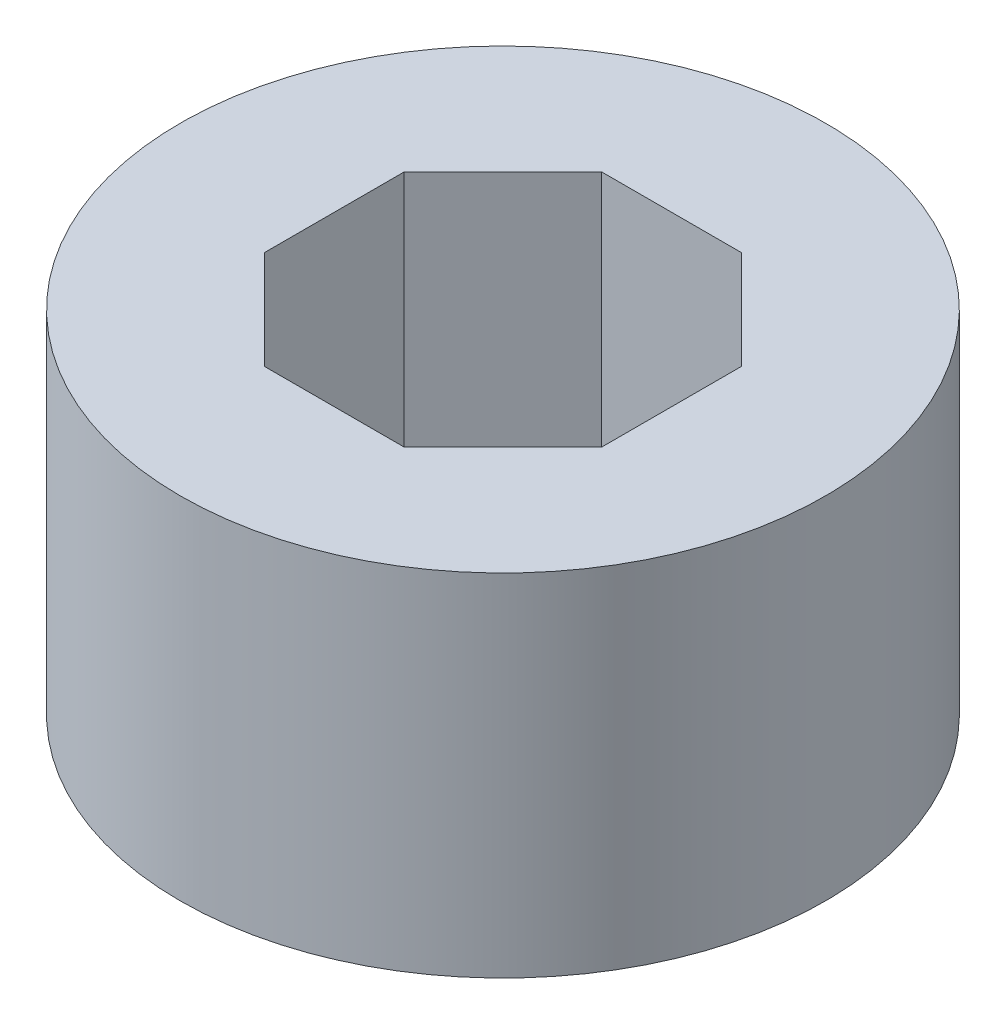
ISO-10303-21;
HEADER;
FILE_DESCRIPTION(('STEP AP214'),'2;1');
FILE_NAME('part.step','',(''),(''),'','','');
FILE_SCHEMA(('AUTOMOTIVE_DESIGN { 1 0 10303 214 1 1 1 1 }'));
ENDSEC;
DATA;
#1=APPLICATION_CONTEXT('core data for automotive mechanical design processes');
#2=APPLICATION_PROTOCOL_DEFINITION('international standard','automotive_design',2000,#1);
#3=PRODUCT_CONTEXT('',#1,'mechanical');
#4=PRODUCT('Part','Part','',(#3));
#5=PRODUCT_RELATED_PRODUCT_CATEGORY('part','',(#4));
#6=PRODUCT_DEFINITION_FORMATION('','',#4);
#7=PRODUCT_DEFINITION_CONTEXT('part definition',#1,'design');
#8=PRODUCT_DEFINITION('design','',#6,#7);
#9=PRODUCT_DEFINITION_SHAPE('','',#8);
#10=(LENGTH_UNIT() NAMED_UNIT(*) SI_UNIT(.MILLI.,.METRE.));
#11=(NAMED_UNIT(*) PLANE_ANGLE_UNIT() SI_UNIT($,.RADIAN.));
#12=(NAMED_UNIT(*) SI_UNIT($,.STERADIAN.) SOLID_ANGLE_UNIT());
#13=UNCERTAINTY_MEASURE_WITH_UNIT(LENGTH_MEASURE(1.E-05),#10,'distance_accuracy_value','');
#14=(GEOMETRIC_REPRESENTATION_CONTEXT(3) GLOBAL_UNCERTAINTY_ASSIGNED_CONTEXT((#13)) GLOBAL_UNIT_ASSIGNED_CONTEXT((#10,
#11,#12)) REPRESENTATION_CONTEXT('',''));
#15=CARTESIAN_POINT('',(0.,0.,0.));
#16=DIRECTION('',(0.,0.,1.));
#17=DIRECTION('',(1.,0.,0.));
#18=AXIS2_PLACEMENT_3D('',#15,#16,#17);
#19=CARTESIAN_POINT('',(0.,5.,0.));
#20=DIRECTION('',(0.,1.,0.));
#21=DIRECTION('',(0.,0.,1.));
#22=AXIS2_PLACEMENT_3D('',#19,#20,#21);
#23=PLANE('',#22);
#24=CARTESIAN_POINT('',(0.,5.,0.));
#25=DIRECTION('',(0.,1.,0.));
#26=DIRECTION('',(0.,0.,1.));
#27=AXIS2_PLACEMENT_3D('',#24,#25,#26);
#28=CIRCLE('',#27,4.6);
#29=CARTESIAN_POINT('',(0.,5.,4.6));
#30=VERTEX_POINT('',#29);
#31=EDGE_CURVE('E11',#30,#30,#28,.T.);
#32=ORIENTED_EDGE('',*,*,#31,.T.);
#33=EDGE_LOOP('',(#32));
#34=FACE_BOUND('',#33,.T.);
#35=DIRECTION('',(-0.707106781186547,0.,0.707106781186548));
#36=VECTOR('',#35,1.);
#37=CARTESIAN_POINT('',(-0.994976924149234,5.,-2.40208678452935));
#38=LINE('',#37,#36);
#39=CARTESIAN_POINT('',(-0.994976924149234,5.,-2.40208678452935));
#40=VERTEX_POINT('',#39);
#41=CARTESIAN_POINT('',(-2.40208678452935,5.,-0.994976924149233));
#42=VERTEX_POINT('',#41);
#43=EDGE_CURVE('E114',#40,#42,#38,.T.);
#44=ORIENTED_EDGE('',*,*,#43,.F.);
#45=DIRECTION('',(-1.,0.,0.));
#46=VECTOR('',#45,1.);
#47=CARTESIAN_POINT('',(0.994976924149234,5.,-2.40208678452935));
#48=LINE('',#47,#46);
#49=CARTESIAN_POINT('',(0.994976924149234,5.,-2.40208678452935));
#50=VERTEX_POINT('',#49);
#51=EDGE_CURVE('E105',#50,#40,#48,.T.);
#52=ORIENTED_EDGE('',*,*,#51,.F.);
#53=DIRECTION('',(-0.707106781186548,0.,-0.707106781186548));
#54=VECTOR('',#53,1.);
#55=CARTESIAN_POINT('',(2.40208678452935,5.,-0.994976924149234));
#56=LINE('',#55,#54);
#57=CARTESIAN_POINT('',(2.40208678452935,5.,-0.994976924149234));
#58=VERTEX_POINT('',#57);
#59=EDGE_CURVE('E145',#58,#50,#56,.T.);
#60=ORIENTED_EDGE('',*,*,#59,.F.);
#61=DIRECTION('',(0.,0.,-1.));
#62=VECTOR('',#61,1.);
#63=CARTESIAN_POINT('',(2.40208678452935,5.,0.994976924149233));
#64=LINE('',#63,#62);
#65=CARTESIAN_POINT('',(2.40208678452935,5.,0.994976924149233));
#66=VERTEX_POINT('',#65);
#67=EDGE_CURVE('E142',#66,#58,#64,.T.);
#68=ORIENTED_EDGE('',*,*,#67,.F.);
#69=DIRECTION('',(0.707106781186547,0.,-0.707106781186548));
#70=VECTOR('',#69,1.);
#71=CARTESIAN_POINT('',(0.994976924149233,5.,2.40208678452935));
#72=LINE('',#71,#70);
#73=CARTESIAN_POINT('',(0.994976924149233,5.,2.40208678452935));
#74=VERTEX_POINT('',#73);
#75=EDGE_CURVE('E139',#74,#66,#72,.T.);
#76=ORIENTED_EDGE('',*,*,#75,.F.);
#77=DIRECTION('',(1.,0.,0.));
#78=VECTOR('',#77,1.);
#79=CARTESIAN_POINT('',(-0.994976924149233,5.,2.40208678452935));
#80=LINE('',#79,#78);
#81=CARTESIAN_POINT('',(-0.994976924149233,5.,2.40208678452935));
#82=VERTEX_POINT('',#81);
#83=EDGE_CURVE('E136',#82,#74,#80,.T.);
#84=ORIENTED_EDGE('',*,*,#83,.F.);
#85=DIRECTION('',(0.707106781186548,0.,0.707106781186547));
#86=VECTOR('',#85,1.);
#87=CARTESIAN_POINT('',(-2.40208678452935,5.,0.994976924149234));
#88=LINE('',#87,#86);
#89=CARTESIAN_POINT('',(-2.40208678452935,5.,0.994976924149234));
#90=VERTEX_POINT('',#89);
#91=EDGE_CURVE('E131',#90,#82,#88,.T.);
#92=ORIENTED_EDGE('',*,*,#91,.F.);
#93=DIRECTION('',(0.,0.,1.));
#94=VECTOR('',#93,1.);
#95=CARTESIAN_POINT('',(-2.40208678452935,5.,-0.994976924149233));
#96=LINE('',#95,#94);
#97=EDGE_CURVE('E127',#42,#90,#96,.T.);
#98=ORIENTED_EDGE('',*,*,#97,.F.);
#99=EDGE_LOOP('',(#44,#52,#60,#68,#76,#84,#92,#98));
#100=FACE_BOUND('',#99,.T.);
#101=ADVANCED_FACE('F39',(#34,#100),#23,.T.);
#102=CARTESIAN_POINT('',(0.,0.,0.));
#103=DIRECTION('',(0.,1.,0.));
#104=DIRECTION('',(0.,0.,1.));
#105=AXIS2_PLACEMENT_3D('',#102,#103,#104);
#106=PLANE('',#105);
#107=CARTESIAN_POINT('',(0.,0.,0.));
#108=DIRECTION('',(0.,1.,0.));
#109=DIRECTION('',(0.,0.,1.));
#110=AXIS2_PLACEMENT_3D('',#107,#108,#109);
#111=CIRCLE('',#110,4.6);
#112=CARTESIAN_POINT('',(0.,0.,4.6));
#113=VERTEX_POINT('',#112);
#114=EDGE_CURVE('E43',#113,#113,#111,.T.);
#115=ORIENTED_EDGE('',*,*,#114,.F.);
#116=EDGE_LOOP('',(#115));
#117=FACE_BOUND('',#116,.T.);
#118=DIRECTION('',(-1.,0.,0.));
#119=VECTOR('',#118,1.);
#120=CARTESIAN_POINT('',(0.994976924149234,0.,-2.40208678452935));
#121=LINE('',#120,#119);
#122=CARTESIAN_POINT('',(0.994976924149234,0.,-2.40208678452935));
#123=VERTEX_POINT('',#122);
#124=CARTESIAN_POINT('',(-0.994976924149234,0.,-2.40208678452935));
#125=VERTEX_POINT('',#124);
#126=EDGE_CURVE('E63',#123,#125,#121,.T.);
#127=ORIENTED_EDGE('',*,*,#126,.T.);
#128=DIRECTION('',(-0.707106781186547,0.,0.707106781186548));
#129=VECTOR('',#128,1.);
#130=CARTESIAN_POINT('',(-0.994976924149234,0.,-2.40208678452935));
#131=LINE('',#130,#129);
#132=CARTESIAN_POINT('',(-2.40208678452935,0.,-0.994976924149233));
#133=VERTEX_POINT('',#132);
#134=EDGE_CURVE('E121',#125,#133,#131,.T.);
#135=ORIENTED_EDGE('',*,*,#134,.T.);
#136=DIRECTION('',(0.,0.,1.));
#137=VECTOR('',#136,1.);
#138=CARTESIAN_POINT('',(-2.40208678452935,0.,-0.994976924149233));
#139=LINE('',#138,#137);
#140=CARTESIAN_POINT('',(-2.40208678452935,0.,0.994976924149234));
#141=VERTEX_POINT('',#140);
#142=EDGE_CURVE('E152',#133,#141,#139,.T.);
#143=ORIENTED_EDGE('',*,*,#142,.T.);
#144=DIRECTION('',(0.707106781186548,0.,0.707106781186547));
#145=VECTOR('',#144,1.);
#146=CARTESIAN_POINT('',(-2.40208678452935,0.,0.994976924149234));
#147=LINE('',#146,#145);
#148=CARTESIAN_POINT('',(-0.994976924149233,0.,2.40208678452935));
#149=VERTEX_POINT('',#148);
#150=EDGE_CURVE('E156',#141,#149,#147,.T.);
#151=ORIENTED_EDGE('',*,*,#150,.T.);
#152=DIRECTION('',(1.,0.,0.));
#153=VECTOR('',#152,1.);
#154=CARTESIAN_POINT('',(-0.994976924149233,0.,2.40208678452935));
#155=LINE('',#154,#153);
#156=CARTESIAN_POINT('',(0.994976924149233,0.,2.40208678452935));
#157=VERTEX_POINT('',#156);
#158=EDGE_CURVE('E160',#149,#157,#155,.T.);
#159=ORIENTED_EDGE('',*,*,#158,.T.);
#160=DIRECTION('',(0.707106781186547,0.,-0.707106781186548));
#161=VECTOR('',#160,1.);
#162=CARTESIAN_POINT('',(0.994976924149233,0.,2.40208678452935));
#163=LINE('',#162,#161);
#164=CARTESIAN_POINT('',(2.40208678452935,0.,0.994976924149233));
#165=VERTEX_POINT('',#164);
#166=EDGE_CURVE('E164',#157,#165,#163,.T.);
#167=ORIENTED_EDGE('',*,*,#166,.T.);
#168=DIRECTION('',(0.,0.,-1.));
#169=VECTOR('',#168,1.);
#170=CARTESIAN_POINT('',(2.40208678452935,0.,0.994976924149233));
#171=LINE('',#170,#169);
#172=CARTESIAN_POINT('',(2.40208678452935,0.,-0.994976924149234));
#173=VERTEX_POINT('',#172);
#174=EDGE_CURVE('E168',#165,#173,#171,.T.);
#175=ORIENTED_EDGE('',*,*,#174,.T.);
#176=DIRECTION('',(-0.707106781186548,0.,-0.707106781186548));
#177=VECTOR('',#176,1.);
#178=CARTESIAN_POINT('',(2.40208678452935,0.,-0.994976924149234));
#179=LINE('',#178,#177);
#180=EDGE_CURVE('E115',#173,#123,#179,.T.);
#181=ORIENTED_EDGE('',*,*,#180,.T.);
#182=EDGE_LOOP('',(#127,#135,#143,#151,#159,#167,#175,#181));
#183=FACE_BOUND('',#182,.T.);
#184=ADVANCED_FACE('F198',(#117,#183),#106,.F.);
#185=CARTESIAN_POINT('',(0.,5.,0.));
#186=DIRECTION('',(0.,-1.,0.));
#187=DIRECTION('',(0.,0.,-1.));
#188=AXIS2_PLACEMENT_3D('',#185,#186,#187);
#189=CYLINDRICAL_SURFACE('',#188,4.6);
#190=ORIENTED_EDGE('',*,*,#31,.F.);
#191=EDGE_LOOP('',(#190));
#192=FACE_BOUND('',#191,.T.);
#193=ORIENTED_EDGE('',*,*,#114,.T.);
#194=EDGE_LOOP('',(#193));
#195=FACE_BOUND('',#194,.T.);
#196=ADVANCED_FACE('F41',(#192,#195),#189,.T.);
#197=CARTESIAN_POINT('',(0.994976924149234,5.,-2.40208678452935));
#198=DIRECTION('',(0.,0.,1.));
#199=DIRECTION('',(1.,0.,0.));
#200=AXIS2_PLACEMENT_3D('',#197,#198,#199);
#201=PLANE('',#200);
#202=ORIENTED_EDGE('',*,*,#126,.F.);
#203=DIRECTION('',(0.,-1.,0.));
#204=VECTOR('',#203,1.);
#205=CARTESIAN_POINT('',(0.994976924149234,5.,-2.40208678452935));
#206=LINE('',#205,#204);
#207=EDGE_CURVE('E109',#50,#123,#206,.T.);
#208=ORIENTED_EDGE('',*,*,#207,.F.);
#209=ORIENTED_EDGE('',*,*,#51,.T.);
#210=DIRECTION('',(0.,-1.,0.));
#211=VECTOR('',#210,1.);
#212=CARTESIAN_POINT('',(-0.994976924149234,5.,-2.40208678452935));
#213=LINE('',#212,#211);
#214=EDGE_CURVE('E108',#40,#125,#213,.T.);
#215=ORIENTED_EDGE('',*,*,#214,.T.);
#216=EDGE_LOOP('',(#202,#208,#209,#215));
#217=FACE_BOUND('',#216,.T.);
#218=ADVANCED_FACE('F107',(#217),#201,.T.);
#219=CARTESIAN_POINT('',(-0.994976924149234,5.,-2.40208678452935));
#220=DIRECTION('',(0.707106781186548,0.,0.707106781186547));
#221=DIRECTION('',(0.707106781186547,0.,-0.707106781186548));
#222=AXIS2_PLACEMENT_3D('',#219,#220,#221);
#223=PLANE('',#222);
#224=ORIENTED_EDGE('',*,*,#134,.F.);
#225=ORIENTED_EDGE('',*,*,#214,.F.);
#226=ORIENTED_EDGE('',*,*,#43,.T.);
#227=DIRECTION('',(0.,-1.,0.));
#228=VECTOR('',#227,1.);
#229=CARTESIAN_POINT('',(-2.40208678452935,5.,-0.994976924149233));
#230=LINE('',#229,#228);
#231=EDGE_CURVE('E123',#42,#133,#230,.T.);
#232=ORIENTED_EDGE('',*,*,#231,.T.);
#233=EDGE_LOOP('',(#224,#225,#226,#232));
#234=FACE_BOUND('',#233,.T.);
#235=ADVANCED_FACE('F118',(#234),#223,.T.);
#236=CARTESIAN_POINT('',(-2.40208678452935,5.,-0.994976924149233));
#237=DIRECTION('',(1.,0.,0.));
#238=DIRECTION('',(0.,0.,-1.));
#239=AXIS2_PLACEMENT_3D('',#236,#237,#238);
#240=PLANE('',#239);
#241=ORIENTED_EDGE('',*,*,#142,.F.);
#242=ORIENTED_EDGE('',*,*,#231,.F.);
#243=ORIENTED_EDGE('',*,*,#97,.T.);
#244=DIRECTION('',(0.,-1.,0.));
#245=VECTOR('',#244,1.);
#246=CARTESIAN_POINT('',(-2.40208678452935,5.,0.994976924149234));
#247=LINE('',#246,#245);
#248=EDGE_CURVE('E188',#90,#141,#247,.T.);
#249=ORIENTED_EDGE('',*,*,#248,.T.);
#250=EDGE_LOOP('',(#241,#242,#243,#249));
#251=FACE_BOUND('',#250,.T.);
#252=ADVANCED_FACE('F194',(#251),#240,.T.);
#253=CARTESIAN_POINT('',(-2.40208678452935,5.,0.994976924149234));
#254=DIRECTION('',(0.707106781186547,0.,-0.707106781186548));
#255=DIRECTION('',(-0.707106781186548,0.,-0.707106781186547));
#256=AXIS2_PLACEMENT_3D('',#253,#254,#255);
#257=PLANE('',#256);
#258=ORIENTED_EDGE('',*,*,#150,.F.);
#259=ORIENTED_EDGE('',*,*,#248,.F.);
#260=ORIENTED_EDGE('',*,*,#91,.T.);
#261=DIRECTION('',(0.,-1.,0.));
#262=VECTOR('',#261,1.);
#263=CARTESIAN_POINT('',(-0.994976924149233,5.,2.40208678452935));
#264=LINE('',#263,#262);
#265=EDGE_CURVE('E185',#82,#149,#264,.T.);
#266=ORIENTED_EDGE('',*,*,#265,.T.);
#267=EDGE_LOOP('',(#258,#259,#260,#266));
#268=FACE_BOUND('',#267,.T.);
#269=ADVANCED_FACE('F216',(#268),#257,.T.);
#270=CARTESIAN_POINT('',(-0.994976924149233,5.,2.40208678452935));
#271=DIRECTION('',(0.,0.,-1.));
#272=DIRECTION('',(-1.,0.,0.));
#273=AXIS2_PLACEMENT_3D('',#270,#271,#272);
#274=PLANE('',#273);
#275=ORIENTED_EDGE('',*,*,#158,.F.);
#276=ORIENTED_EDGE('',*,*,#265,.F.);
#277=ORIENTED_EDGE('',*,*,#83,.T.);
#278=DIRECTION('',(0.,-1.,0.));
#279=VECTOR('',#278,1.);
#280=CARTESIAN_POINT('',(0.994976924149233,5.,2.40208678452935));
#281=LINE('',#280,#279);
#282=EDGE_CURVE('E182',#74,#157,#281,.T.);
#283=ORIENTED_EDGE('',*,*,#282,.T.);
#284=EDGE_LOOP('',(#275,#276,#277,#283));
#285=FACE_BOUND('',#284,.T.);
#286=ADVANCED_FACE('F213',(#285),#274,.T.);
#287=CARTESIAN_POINT('',(0.994976924149233,5.,2.40208678452935));
#288=DIRECTION('',(-0.707106781186548,0.,-0.707106781186547));
#289=DIRECTION('',(-0.707106781186547,0.,0.707106781186548));
#290=AXIS2_PLACEMENT_3D('',#287,#288,#289);
#291=PLANE('',#290);
#292=ORIENTED_EDGE('',*,*,#166,.F.);
#293=ORIENTED_EDGE('',*,*,#282,.F.);
#294=ORIENTED_EDGE('',*,*,#75,.T.);
#295=DIRECTION('',(0.,-1.,0.));
#296=VECTOR('',#295,1.);
#297=CARTESIAN_POINT('',(2.40208678452935,5.,0.994976924149233));
#298=LINE('',#297,#296);
#299=EDGE_CURVE('E179',#66,#165,#298,.T.);
#300=ORIENTED_EDGE('',*,*,#299,.T.);
#301=EDGE_LOOP('',(#292,#293,#294,#300));
#302=FACE_BOUND('',#301,.T.);
#303=ADVANCED_FACE('F209',(#302),#291,.T.);
#304=CARTESIAN_POINT('',(2.40208678452935,5.,0.994976924149233));
#305=DIRECTION('',(-1.,0.,0.));
#306=DIRECTION('',(0.,0.,1.));
#307=AXIS2_PLACEMENT_3D('',#304,#305,#306);
#308=PLANE('',#307);
#309=ORIENTED_EDGE('',*,*,#174,.F.);
#310=ORIENTED_EDGE('',*,*,#299,.F.);
#311=ORIENTED_EDGE('',*,*,#67,.T.);
#312=DIRECTION('',(0.,-1.,0.));
#313=VECTOR('',#312,1.);
#314=CARTESIAN_POINT('',(2.40208678452935,5.,-0.994976924149234));
#315=LINE('',#314,#313);
#316=EDGE_CURVE('E55',#58,#173,#315,.T.);
#317=ORIENTED_EDGE('',*,*,#316,.T.);
#318=EDGE_LOOP('',(#309,#310,#311,#317));
#319=FACE_BOUND('',#318,.T.);
#320=ADVANCED_FACE('F206',(#319),#308,.T.);
#321=CARTESIAN_POINT('',(2.40208678452935,5.,-0.994976924149234));
#322=DIRECTION('',(-0.707106781186548,0.,0.707106781186548));
#323=DIRECTION('',(0.707106781186548,0.,0.707106781186548));
#324=AXIS2_PLACEMENT_3D('',#321,#322,#323);
#325=PLANE('',#324);
#326=ORIENTED_EDGE('',*,*,#180,.F.);
#327=ORIENTED_EDGE('',*,*,#316,.F.);
#328=ORIENTED_EDGE('',*,*,#59,.T.);
#329=ORIENTED_EDGE('',*,*,#207,.T.);
#330=EDGE_LOOP('',(#326,#327,#328,#329));
#331=FACE_BOUND('',#330,.T.);
#332=ADVANCED_FACE('F200',(#331),#325,.T.);
#333=CLOSED_SHELL('',(#101,#184,#196,#218,#235,#252,#269,#286,#303,#320,#332));
#334=MANIFOLD_SOLID_BREP('B2',#333);
#335=ADVANCED_BREP_SHAPE_REPRESENTATION('',(#18,#334),#14);
#336=SHAPE_DEFINITION_REPRESENTATION(#9,#335);
ENDSEC;
END-ISO-10303-21;
